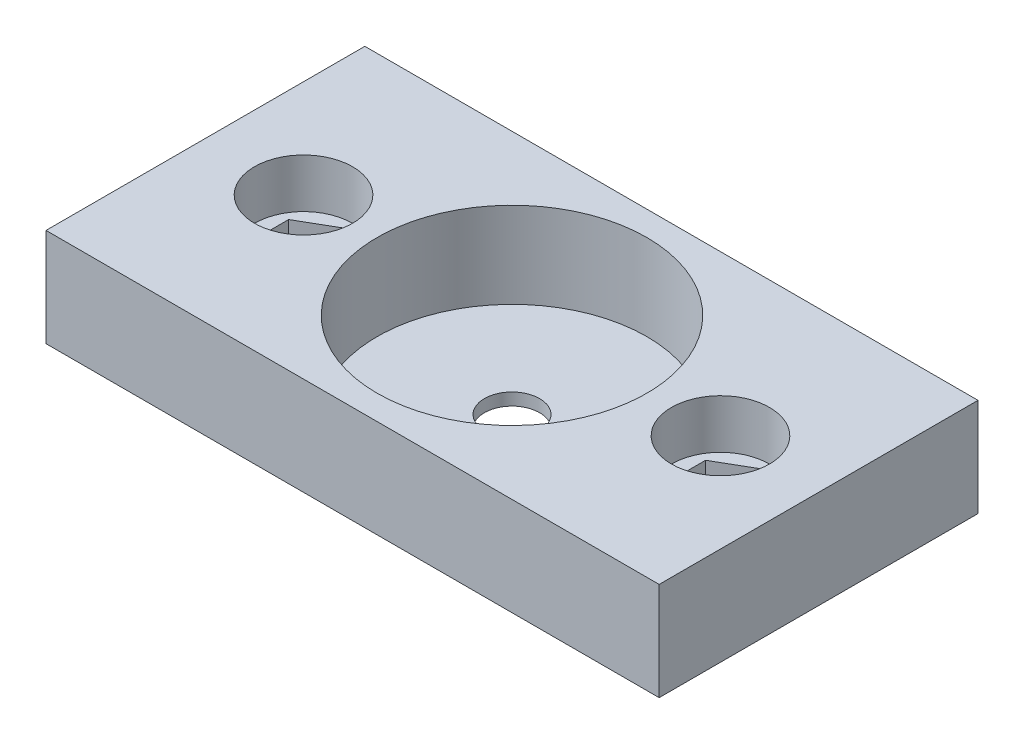
ISO-10303-21;
HEADER;
FILE_DESCRIPTION(('STEP AP214'),'2;1');
FILE_NAME('part.step','',(''),(''),'','','');
FILE_SCHEMA(('AUTOMOTIVE_DESIGN { 1 0 10303 214 1 1 1 1 }'));
ENDSEC;
DATA;
#1=APPLICATION_CONTEXT('core data for automotive mechanical design processes');
#2=APPLICATION_PROTOCOL_DEFINITION('international standard','automotive_design',2000,#1);
#3=PRODUCT_CONTEXT('',#1,'mechanical');
#4=PRODUCT('Part','Part','',(#3));
#5=PRODUCT_RELATED_PRODUCT_CATEGORY('part','',(#4));
#6=PRODUCT_DEFINITION_FORMATION('','',#4);
#7=PRODUCT_DEFINITION_CONTEXT('part definition',#1,'design');
#8=PRODUCT_DEFINITION('design','',#6,#7);
#9=PRODUCT_DEFINITION_SHAPE('','',#8);
#10=(LENGTH_UNIT() NAMED_UNIT(*) SI_UNIT(.MILLI.,.METRE.));
#11=(NAMED_UNIT(*) PLANE_ANGLE_UNIT() SI_UNIT($,.RADIAN.));
#12=(NAMED_UNIT(*) SI_UNIT($,.STERADIAN.) SOLID_ANGLE_UNIT());
#13=UNCERTAINTY_MEASURE_WITH_UNIT(LENGTH_MEASURE(1.E-05),#10,'distance_accuracy_value','');
#14=(GEOMETRIC_REPRESENTATION_CONTEXT(3) GLOBAL_UNCERTAINTY_ASSIGNED_CONTEXT((#13)) GLOBAL_UNIT_ASSIGNED_CONTEXT((#10,
#11,#12)) REPRESENTATION_CONTEXT('',''));
#15=CARTESIAN_POINT('',(0.,0.,0.));
#16=DIRECTION('',(0.,0.,1.));
#17=DIRECTION('',(1.,0.,0.));
#18=AXIS2_PLACEMENT_3D('',#15,#16,#17);
#19=CARTESIAN_POINT('',(-17.,4.,0.));
#20=DIRECTION('',(0.,-1.,0.));
#21=DIRECTION('',(0.,0.,-1.));
#22=AXIS2_PLACEMENT_3D('',#19,#20,#21);
#23=PLANE('',#22);
#24=CARTESIAN_POINT('',(-17.,4.,0.));
#25=DIRECTION('',(0.,1.,0.));
#26=DIRECTION('',(0.,0.,-1.));
#27=AXIS2_PLACEMENT_3D('',#24,#25,#26);
#28=CIRCLE('',#27,4.00000000000001);
#29=CARTESIAN_POINT('',(-17.,4.,-4.00000000000001));
#30=VERTEX_POINT('',#29);
#31=EDGE_CURVE('E265',#30,#30,#28,.T.);
#32=ORIENTED_EDGE('',*,*,#31,.T.);
#33=EDGE_LOOP('',(#32));
#34=FACE_BOUND('',#33,.T.);
#35=DIRECTION('',(0.866025403784438,0.,-0.5));
#36=VECTOR('',#35,1.);
#37=CARTESIAN_POINT('',(-14.125,4.,1.65988202392018));
#38=LINE('',#37,#36);
#39=CARTESIAN_POINT('',(-17.,4.,3.31976404784035));
#40=VERTEX_POINT('',#39);
#41=CARTESIAN_POINT('',(-14.125,4.,1.65988202392018));
#42=VERTEX_POINT('',#41);
#43=EDGE_CURVE('E233',#40,#42,#38,.T.);
#44=ORIENTED_EDGE('',*,*,#43,.F.);
#45=DIRECTION('',(0.866025403784439,0.,0.5));
#46=VECTOR('',#45,1.);
#47=CARTESIAN_POINT('',(-17.,4.,3.31976404784035));
#48=LINE('',#47,#46);
#49=CARTESIAN_POINT('',(-19.875,4.,1.65988202392017));
#50=VERTEX_POINT('',#49);
#51=EDGE_CURVE('E217',#50,#40,#48,.T.);
#52=ORIENTED_EDGE('',*,*,#51,.F.);
#53=DIRECTION('',(0.,0.,1.));
#54=VECTOR('',#53,1.);
#55=CARTESIAN_POINT('',(-19.875,4.,1.65988202392017));
#56=LINE('',#55,#54);
#57=CARTESIAN_POINT('',(-19.875,4.,-1.65988202392018));
#58=VERTEX_POINT('',#57);
#59=EDGE_CURVE('E54',#58,#50,#56,.T.);
#60=ORIENTED_EDGE('',*,*,#59,.F.);
#61=DIRECTION('',(-0.866025403784439,0.,0.5));
#62=VECTOR('',#61,1.);
#63=CARTESIAN_POINT('',(-19.875,4.,-1.65988202392018));
#64=LINE('',#63,#62);
#65=CARTESIAN_POINT('',(-17.,4.,-3.31976404784035));
#66=VERTEX_POINT('',#65);
#67=EDGE_CURVE('E242',#66,#58,#64,.T.);
#68=ORIENTED_EDGE('',*,*,#67,.F.);
#69=DIRECTION('',(-0.866025403784439,0.,-0.5));
#70=VECTOR('',#69,1.);
#71=CARTESIAN_POINT('',(-17.,4.,-3.31976404784035));
#72=LINE('',#71,#70);
#73=CARTESIAN_POINT('',(-14.125,4.,-1.65988202392018));
#74=VERTEX_POINT('',#73);
#75=EDGE_CURVE('E239',#74,#66,#72,.T.);
#76=ORIENTED_EDGE('',*,*,#75,.F.);
#77=DIRECTION('',(0.,0.,-1.));
#78=VECTOR('',#77,1.);
#79=CARTESIAN_POINT('',(-14.125,4.,-1.65988202392018));
#80=LINE('',#79,#78);
#81=EDGE_CURVE('E236',#42,#74,#80,.T.);
#82=ORIENTED_EDGE('',*,*,#81,.F.);
#83=EDGE_LOOP('',(#44,#52,#60,#68,#76,#82));
#84=FACE_BOUND('',#83,.T.);
#85=ADVANCED_FACE('F39',(#34,#84),#23,.F.);
#86=CARTESIAN_POINT('',(-25.,8.,-13.));
#87=DIRECTION('',(1.,0.,0.));
#88=DIRECTION('',(0.,0.,-1.));
#89=AXIS2_PLACEMENT_3D('',#86,#87,#88);
#90=PLANE('',#89);
#91=DIRECTION('',(0.,0.,1.));
#92=VECTOR('',#91,1.);
#93=CARTESIAN_POINT('',(-25.,0.,-13.));
#94=LINE('',#93,#92);
#95=CARTESIAN_POINT('',(-25.,0.,-13.));
#96=VERTEX_POINT('',#95);
#97=CARTESIAN_POINT('',(-25.,0.,13.));
#98=VERTEX_POINT('',#97);
#99=EDGE_CURVE('E281',#96,#98,#94,.T.);
#100=ORIENTED_EDGE('',*,*,#99,.T.);
#101=DIRECTION('',(0.,-1.,0.));
#102=VECTOR('',#101,1.);
#103=CARTESIAN_POINT('',(-25.,8.,13.));
#104=LINE('',#103,#102);
#105=CARTESIAN_POINT('',(-25.,8.,13.));
#106=VERTEX_POINT('',#105);
#107=EDGE_CURVE('E12',#106,#98,#104,.T.);
#108=ORIENTED_EDGE('',*,*,#107,.F.);
#109=DIRECTION('',(0.,0.,1.));
#110=VECTOR('',#109,1.);
#111=CARTESIAN_POINT('',(-25.,8.,-13.));
#112=LINE('',#111,#110);
#113=CARTESIAN_POINT('',(-25.,8.,-13.));
#114=VERTEX_POINT('',#113);
#115=EDGE_CURVE('E282',#114,#106,#112,.T.);
#116=ORIENTED_EDGE('',*,*,#115,.F.);
#117=DIRECTION('',(0.,-1.,0.));
#118=VECTOR('',#117,1.);
#119=CARTESIAN_POINT('',(-25.,8.,-13.));
#120=LINE('',#119,#118);
#121=EDGE_CURVE('E292',#114,#96,#120,.T.);
#122=ORIENTED_EDGE('',*,*,#121,.T.);
#123=EDGE_LOOP('',(#100,#108,#116,#122));
#124=FACE_BOUND('',#123,.T.);
#125=ADVANCED_FACE('F41',(#124),#90,.F.);
#126=CARTESIAN_POINT('',(-25.,8.,13.));
#127=DIRECTION('',(0.,0.,-1.));
#128=DIRECTION('',(-1.,0.,0.));
#129=AXIS2_PLACEMENT_3D('',#126,#127,#128);
#130=PLANE('',#129);
#131=DIRECTION('',(1.,0.,0.));
#132=VECTOR('',#131,1.);
#133=CARTESIAN_POINT('',(-25.,0.,13.));
#134=LINE('',#133,#132);
#135=CARTESIAN_POINT('',(25.,0.,13.));
#136=VERTEX_POINT('',#135);
#137=EDGE_CURVE('E295',#98,#136,#134,.T.);
#138=ORIENTED_EDGE('',*,*,#137,.T.);
#139=DIRECTION('',(0.,-1.,0.));
#140=VECTOR('',#139,1.);
#141=CARTESIAN_POINT('',(25.,8.,13.));
#142=LINE('',#141,#140);
#143=CARTESIAN_POINT('',(25.,8.,13.));
#144=VERTEX_POINT('',#143);
#145=EDGE_CURVE('E47',#144,#136,#142,.T.);
#146=ORIENTED_EDGE('',*,*,#145,.F.);
#147=DIRECTION('',(1.,0.,0.));
#148=VECTOR('',#147,1.);
#149=CARTESIAN_POINT('',(-25.,8.,13.));
#150=LINE('',#149,#148);
#151=EDGE_CURVE('E285',#106,#144,#150,.T.);
#152=ORIENTED_EDGE('',*,*,#151,.F.);
#153=ORIENTED_EDGE('',*,*,#107,.T.);
#154=EDGE_LOOP('',(#138,#146,#152,#153));
#155=FACE_BOUND('',#154,.T.);
#156=ADVANCED_FACE('F325',(#155),#130,.F.);
#157=CARTESIAN_POINT('',(25.,8.,-13.));
#158=DIRECTION('',(-1.,0.,0.));
#159=DIRECTION('',(0.,0.,1.));
#160=AXIS2_PLACEMENT_3D('',#157,#158,#159);
#161=PLANE('',#160);
#162=DIRECTION('',(0.,0.,-1.));
#163=VECTOR('',#162,1.);
#164=CARTESIAN_POINT('',(25.,0.,-13.));
#165=LINE('',#164,#163);
#166=CARTESIAN_POINT('',(25.,0.,-13.));
#167=VERTEX_POINT('',#166);
#168=EDGE_CURVE('E297',#136,#167,#165,.T.);
#169=ORIENTED_EDGE('',*,*,#168,.T.);
#170=DIRECTION('',(0.,-1.,0.));
#171=VECTOR('',#170,1.);
#172=CARTESIAN_POINT('',(25.,8.,-13.));
#173=LINE('',#172,#171);
#174=CARTESIAN_POINT('',(25.,8.,-13.));
#175=VERTEX_POINT('',#174);
#176=EDGE_CURVE('E302',#175,#167,#173,.T.);
#177=ORIENTED_EDGE('',*,*,#176,.F.);
#178=DIRECTION('',(0.,0.,-1.));
#179=VECTOR('',#178,1.);
#180=CARTESIAN_POINT('',(25.,8.,-13.));
#181=LINE('',#180,#179);
#182=EDGE_CURVE('E288',#144,#175,#181,.T.);
#183=ORIENTED_EDGE('',*,*,#182,.F.);
#184=ORIENTED_EDGE('',*,*,#145,.T.);
#185=EDGE_LOOP('',(#169,#177,#183,#184));
#186=FACE_BOUND('',#185,.T.);
#187=ADVANCED_FACE('F309',(#186),#161,.F.);
#188=CARTESIAN_POINT('',(-25.,8.,-13.));
#189=DIRECTION('',(0.,0.,1.));
#190=DIRECTION('',(1.,0.,0.));
#191=AXIS2_PLACEMENT_3D('',#188,#189,#190);
#192=PLANE('',#191);
#193=DIRECTION('',(-1.,0.,0.));
#194=VECTOR('',#193,1.);
#195=CARTESIAN_POINT('',(-25.,0.,-13.));
#196=LINE('',#195,#194);
#197=EDGE_CURVE('E286',#167,#96,#196,.T.);
#198=ORIENTED_EDGE('',*,*,#197,.T.);
#199=ORIENTED_EDGE('',*,*,#121,.F.);
#200=DIRECTION('',(-1.,0.,0.));
#201=VECTOR('',#200,1.);
#202=CARTESIAN_POINT('',(-25.,8.,-13.));
#203=LINE('',#202,#201);
#204=EDGE_CURVE('E290',#175,#114,#203,.T.);
#205=ORIENTED_EDGE('',*,*,#204,.F.);
#206=ORIENTED_EDGE('',*,*,#176,.T.);
#207=EDGE_LOOP('',(#198,#199,#205,#206));
#208=FACE_BOUND('',#207,.T.);
#209=ADVANCED_FACE('F318',(#208),#192,.F.);
#210=CARTESIAN_POINT('',(0.,8.,0.));
#211=DIRECTION('',(0.,1.,0.));
#212=DIRECTION('',(0.,0.,1.));
#213=AXIS2_PLACEMENT_3D('',#210,#211,#212);
#214=PLANE('',#213);
#215=CARTESIAN_POINT('',(17.,8.,0.));
#216=DIRECTION('',(0.,1.,0.));
#217=DIRECTION('',(0.,0.,1.));
#218=AXIS2_PLACEMENT_3D('',#215,#216,#217);
#219=CIRCLE('',#218,4.00000000000001);
#220=CARTESIAN_POINT('',(17.,8.,4.00000000000001));
#221=VERTEX_POINT('',#220);
#222=EDGE_CURVE('E262',#221,#221,#219,.T.);
#223=ORIENTED_EDGE('',*,*,#222,.F.);
#224=EDGE_LOOP('',(#223));
#225=FACE_BOUND('',#224,.T.);
#226=CARTESIAN_POINT('',(-17.,8.,0.));
#227=DIRECTION('',(0.,1.,0.));
#228=DIRECTION('',(0.,0.,-1.));
#229=AXIS2_PLACEMENT_3D('',#226,#227,#228);
#230=CIRCLE('',#229,4.00000000000001);
#231=CARTESIAN_POINT('',(-17.,8.,-4.00000000000001));
#232=VERTEX_POINT('',#231);
#233=EDGE_CURVE('E205',#232,#232,#230,.T.);
#234=ORIENTED_EDGE('',*,*,#233,.F.);
#235=EDGE_LOOP('',(#234));
#236=FACE_BOUND('',#235,.T.);
#237=CARTESIAN_POINT('',(0.,8.,0.));
#238=DIRECTION('',(0.,1.,0.));
#239=DIRECTION('',(0.,0.,1.));
#240=AXIS2_PLACEMENT_3D('',#237,#238,#239);
#241=CIRCLE('',#240,11.);
#242=CARTESIAN_POINT('',(0.,8.,11.));
#243=VERTEX_POINT('',#242);
#244=EDGE_CURVE('E273',#243,#243,#241,.T.);
#245=ORIENTED_EDGE('',*,*,#244,.F.);
#246=EDGE_LOOP('',(#245));
#247=FACE_BOUND('',#246,.T.);
#248=ORIENTED_EDGE('',*,*,#115,.T.);
#249=ORIENTED_EDGE('',*,*,#151,.T.);
#250=ORIENTED_EDGE('',*,*,#182,.T.);
#251=ORIENTED_EDGE('',*,*,#204,.T.);
#252=EDGE_LOOP('',(#248,#249,#250,#251));
#253=FACE_BOUND('',#252,.T.);
#254=ADVANCED_FACE('F324',(#225,#236,#247,#253),#214,.T.);
#255=CARTESIAN_POINT('',(0.,0.,0.));
#256=DIRECTION('',(0.,1.,0.));
#257=DIRECTION('',(0.,0.,1.));
#258=AXIS2_PLACEMENT_3D('',#255,#256,#257);
#259=PLANE('',#258);
#260=CARTESIAN_POINT('',(17.,0.,0.));
#261=DIRECTION('',(0.,1.,0.));
#262=DIRECTION('',(0.,0.,1.));
#263=AXIS2_PLACEMENT_3D('',#260,#261,#262);
#264=CIRCLE('',#263,1.7);
#265=CARTESIAN_POINT('',(17.,0.,1.7));
#266=VERTEX_POINT('',#265);
#267=EDGE_CURVE('E600',#266,#266,#264,.T.);
#268=ORIENTED_EDGE('',*,*,#267,.T.);
#269=EDGE_LOOP('',(#268));
#270=FACE_BOUND('',#269,.T.);
#271=CARTESIAN_POINT('',(-17.,0.,0.));
#272=DIRECTION('',(0.,1.,0.));
#273=DIRECTION('',(0.,0.,1.));
#274=AXIS2_PLACEMENT_3D('',#271,#272,#273);
#275=CIRCLE('',#274,1.7);
#276=CARTESIAN_POINT('',(-17.,0.,1.7));
#277=VERTEX_POINT('',#276);
#278=EDGE_CURVE('E182',#277,#277,#275,.T.);
#279=ORIENTED_EDGE('',*,*,#278,.T.);
#280=EDGE_LOOP('',(#279));
#281=FACE_BOUND('',#280,.T.);
#282=CARTESIAN_POINT('',(0.,0.,0.));
#283=DIRECTION('',(0.,1.,0.));
#284=DIRECTION('',(0.,0.,1.));
#285=AXIS2_PLACEMENT_3D('',#282,#283,#284);
#286=CIRCLE('',#285,2.25);
#287=CARTESIAN_POINT('',(0.,0.,2.25));
#288=VERTEX_POINT('',#287);
#289=EDGE_CURVE('E270',#288,#288,#286,.T.);
#290=ORIENTED_EDGE('',*,*,#289,.T.);
#291=EDGE_LOOP('',(#290));
#292=FACE_BOUND('',#291,.T.);
#293=ORIENTED_EDGE('',*,*,#99,.F.);
#294=ORIENTED_EDGE('',*,*,#197,.F.);
#295=ORIENTED_EDGE('',*,*,#168,.F.);
#296=ORIENTED_EDGE('',*,*,#137,.F.);
#297=EDGE_LOOP('',(#293,#294,#295,#296));
#298=FACE_BOUND('',#297,.T.);
#299=ADVANCED_FACE('F315',(#270,#281,#292,#298),#259,.F.);
#300=CARTESIAN_POINT('',(0.,-31.1126983722081,0.));
#301=DIRECTION('',(0.,1.,0.));
#302=DIRECTION('',(0.,0.,1.));
#303=AXIS2_PLACEMENT_3D('',#300,#301,#302);
#304=CYLINDRICAL_SURFACE('',#303,11.);
#305=CARTESIAN_POINT('',(0.,1.,0.));
#306=DIRECTION('',(0.,1.,0.));
#307=DIRECTION('',(0.,0.,1.));
#308=AXIS2_PLACEMENT_3D('',#305,#306,#307);
#309=CIRCLE('',#308,11.);
#310=CARTESIAN_POINT('',(0.,1.,11.));
#311=VERTEX_POINT('',#310);
#312=EDGE_CURVE('E278',#311,#311,#309,.F.);
#313=ORIENTED_EDGE('',*,*,#312,.T.);
#314=EDGE_LOOP('',(#313));
#315=FACE_BOUND('',#314,.T.);
#316=ORIENTED_EDGE('',*,*,#244,.T.);
#317=EDGE_LOOP('',(#316));
#318=FACE_BOUND('',#317,.T.);
#319=ADVANCED_FACE('F353',(#315,#318),#304,.F.);
#320=CARTESIAN_POINT('',(0.,1.,0.));
#321=DIRECTION('',(0.,1.,0.));
#322=DIRECTION('',(0.,0.,1.));
#323=AXIS2_PLACEMENT_3D('',#320,#321,#322);
#324=PLANE('',#323);
#325=CARTESIAN_POINT('',(0.,1.,0.));
#326=DIRECTION('',(0.,1.,0.));
#327=DIRECTION('',(0.,0.,1.));
#328=AXIS2_PLACEMENT_3D('',#325,#326,#327);
#329=CIRCLE('',#328,2.25);
#330=CARTESIAN_POINT('',(0.,1.,2.25));
#331=VERTEX_POINT('',#330);
#332=EDGE_CURVE('E261',#331,#331,#329,.T.);
#333=ORIENTED_EDGE('',*,*,#332,.F.);
#334=EDGE_LOOP('',(#333));
#335=FACE_BOUND('',#334,.T.);
#336=ORIENTED_EDGE('',*,*,#312,.F.);
#337=EDGE_LOOP('',(#336));
#338=FACE_BOUND('',#337,.T.);
#339=ADVANCED_FACE('F349',(#335,#338),#324,.T.);
#340=CARTESIAN_POINT('',(0.,0.,0.));
#341=DIRECTION('',(0.,1.,0.));
#342=DIRECTION('',(0.,0.,1.));
#343=AXIS2_PLACEMENT_3D('',#340,#341,#342);
#344=CYLINDRICAL_SURFACE('',#343,2.25);
#345=ORIENTED_EDGE('',*,*,#289,.F.);
#346=EDGE_LOOP('',(#345));
#347=FACE_BOUND('',#346,.T.);
#348=ORIENTED_EDGE('',*,*,#332,.T.);
#349=EDGE_LOOP('',(#348));
#350=FACE_BOUND('',#349,.T.);
#351=ADVANCED_FACE('F345',(#347,#350),#344,.F.);
#352=CARTESIAN_POINT('',(-17.,4.,0.));
#353=DIRECTION('',(0.,1.,0.));
#354=DIRECTION('',(0.,0.,1.));
#355=AXIS2_PLACEMENT_3D('',#352,#353,#354);
#356=CYLINDRICAL_SURFACE('',#355,4.00000000000001);
#357=ORIENTED_EDGE('',*,*,#31,.F.);
#358=EDGE_LOOP('',(#357));
#359=FACE_BOUND('',#358,.T.);
#360=ORIENTED_EDGE('',*,*,#233,.T.);
#361=EDGE_LOOP('',(#360));
#362=FACE_BOUND('',#361,.T.);
#363=ADVANCED_FACE('F342',(#359,#362),#356,.F.);
#364=CARTESIAN_POINT('',(17.,4.,0.));
#365=DIRECTION('',(0.,1.,0.));
#366=DIRECTION('',(0.,0.,1.));
#367=AXIS2_PLACEMENT_3D('',#364,#365,#366);
#368=CYLINDRICAL_SURFACE('',#367,4.00000000000001);
#369=CARTESIAN_POINT('',(17.,4.,0.));
#370=DIRECTION('',(0.,1.,0.));
#371=DIRECTION('',(0.,0.,1.));
#372=AXIS2_PLACEMENT_3D('',#369,#370,#371);
#373=CIRCLE('',#372,4.00000000000001);
#374=CARTESIAN_POINT('',(17.,4.,4.00000000000001));
#375=VERTEX_POINT('',#374);
#376=EDGE_CURVE('E258',#375,#375,#373,.T.);
#377=ORIENTED_EDGE('',*,*,#376,.F.);
#378=EDGE_LOOP('',(#377));
#379=FACE_BOUND('',#378,.T.);
#380=ORIENTED_EDGE('',*,*,#222,.T.);
#381=EDGE_LOOP('',(#380));
#382=FACE_BOUND('',#381,.T.);
#383=ADVANCED_FACE('F340',(#379,#382),#368,.F.);
#384=CARTESIAN_POINT('',(17.,4.,0.));
#385=DIRECTION('',(0.,1.,0.));
#386=DIRECTION('',(0.,0.,1.));
#387=AXIS2_PLACEMENT_3D('',#384,#385,#386);
#388=PLANE('',#387);
#389=DIRECTION('',(0.866025403784439,0.,-0.5));
#390=VECTOR('',#389,1.);
#391=CARTESIAN_POINT('',(17.,4.,3.31976404784035));
#392=LINE('',#391,#390);
#393=CARTESIAN_POINT('',(17.,4.,3.31976404784035));
#394=VERTEX_POINT('',#393);
#395=CARTESIAN_POINT('',(19.875,4.,1.65988202392017));
#396=VERTEX_POINT('',#395);
#397=EDGE_CURVE('E159',#394,#396,#392,.T.);
#398=ORIENTED_EDGE('',*,*,#397,.F.);
#399=DIRECTION('',(0.866025403784438,0.,0.5));
#400=VECTOR('',#399,1.);
#401=CARTESIAN_POINT('',(14.125,4.,1.65988202392018));
#402=LINE('',#401,#400);
#403=CARTESIAN_POINT('',(14.125,4.,1.65988202392018));
#404=VERTEX_POINT('',#403);
#405=EDGE_CURVE('E177',#404,#394,#402,.T.);
#406=ORIENTED_EDGE('',*,*,#405,.F.);
#407=DIRECTION('',(0.,0.,1.));
#408=VECTOR('',#407,1.);
#409=CARTESIAN_POINT('',(14.125,4.,-1.65988202392018));
#410=LINE('',#409,#408);
#411=CARTESIAN_POINT('',(14.125,4.,-1.65988202392018));
#412=VERTEX_POINT('',#411);
#413=EDGE_CURVE('E62',#412,#404,#410,.T.);
#414=ORIENTED_EDGE('',*,*,#413,.F.);
#415=DIRECTION('',(-0.866025403784439,0.,0.5));
#416=VECTOR('',#415,1.);
#417=CARTESIAN_POINT('',(17.,4.,-3.31976404784035));
#418=LINE('',#417,#416);
#419=CARTESIAN_POINT('',(17.,4.,-3.31976404784035));
#420=VERTEX_POINT('',#419);
#421=EDGE_CURVE('E199',#420,#412,#418,.T.);
#422=ORIENTED_EDGE('',*,*,#421,.F.);
#423=DIRECTION('',(-0.866025403784439,0.,-0.5));
#424=VECTOR('',#423,1.);
#425=CARTESIAN_POINT('',(19.875,4.,-1.65988202392018));
#426=LINE('',#425,#424);
#427=CARTESIAN_POINT('',(19.875,4.,-1.65988202392018));
#428=VERTEX_POINT('',#427);
#429=EDGE_CURVE('E196',#428,#420,#426,.T.);
#430=ORIENTED_EDGE('',*,*,#429,.F.);
#431=DIRECTION('',(0.,0.,-1.));
#432=VECTOR('',#431,1.);
#433=CARTESIAN_POINT('',(19.875,4.,1.65988202392017));
#434=LINE('',#433,#432);
#435=EDGE_CURVE('E193',#396,#428,#434,.T.);
#436=ORIENTED_EDGE('',*,*,#435,.F.);
#437=EDGE_LOOP('',(#398,#406,#414,#422,#430,#436));
#438=FACE_BOUND('',#437,.T.);
#439=ORIENTED_EDGE('',*,*,#376,.T.);
#440=EDGE_LOOP('',(#439));
#441=FACE_BOUND('',#440,.T.);
#442=ADVANCED_FACE('F401',(#438,#441),#388,.T.);
#443=CARTESIAN_POINT('',(17.,1.8,3.31976404784035));
#444=DIRECTION('',(0.5,0.,0.866025403784438));
#445=DIRECTION('',(0.866025403784439,0.,-0.5));
#446=AXIS2_PLACEMENT_3D('',#443,#444,#445);
#447=PLANE('',#446);
#448=ORIENTED_EDGE('',*,*,#397,.T.);
#449=DIRECTION('',(0.,1.,0.));
#450=VECTOR('',#449,1.);
#451=CARTESIAN_POINT('',(19.875,1.8,1.65988202392017));
#452=LINE('',#451,#450);
#453=CARTESIAN_POINT('',(19.875,1.8,1.65988202392017));
#454=VERTEX_POINT('',#453);
#455=EDGE_CURVE('E152',#454,#396,#452,.T.);
#456=ORIENTED_EDGE('',*,*,#455,.F.);
#457=DIRECTION('',(0.866025403784439,0.,-0.5));
#458=VECTOR('',#457,1.);
#459=CARTESIAN_POINT('',(17.,1.8,3.31976404784035));
#460=LINE('',#459,#458);
#461=CARTESIAN_POINT('',(17.,1.8,3.31976404784035));
#462=VERTEX_POINT('',#461);
#463=EDGE_CURVE('E156',#462,#454,#460,.T.);
#464=ORIENTED_EDGE('',*,*,#463,.F.);
#465=DIRECTION('',(0.,1.,0.));
#466=VECTOR('',#465,1.);
#467=CARTESIAN_POINT('',(17.,1.8,3.31976404784035));
#468=LINE('',#467,#466);
#469=EDGE_CURVE('E203',#462,#394,#468,.T.);
#470=ORIENTED_EDGE('',*,*,#469,.T.);
#471=EDGE_LOOP('',(#448,#456,#464,#470));
#472=FACE_BOUND('',#471,.T.);
#473=ADVANCED_FACE('F154',(#472),#447,.F.);
#474=CARTESIAN_POINT('',(14.125,1.8,1.65988202392018));
#475=DIRECTION('',(-0.5,0.,0.866025403784438));
#476=DIRECTION('',(0.866025403784438,0.,0.5));
#477=AXIS2_PLACEMENT_3D('',#474,#475,#476);
#478=PLANE('',#477);
#479=ORIENTED_EDGE('',*,*,#405,.T.);
#480=ORIENTED_EDGE('',*,*,#469,.F.);
#481=DIRECTION('',(0.866025403784438,0.,0.5));
#482=VECTOR('',#481,1.);
#483=CARTESIAN_POINT('',(14.125,1.8,1.65988202392018));
#484=LINE('',#483,#482);
#485=CARTESIAN_POINT('',(14.125,1.8,1.65988202392018));
#486=VERTEX_POINT('',#485);
#487=EDGE_CURVE('E164',#486,#462,#484,.T.);
#488=ORIENTED_EDGE('',*,*,#487,.F.);
#489=DIRECTION('',(0.,1.,0.));
#490=VECTOR('',#489,1.);
#491=CARTESIAN_POINT('',(14.125,1.8,1.65988202392018));
#492=LINE('',#491,#490);
#493=EDGE_CURVE('E206',#486,#404,#492,.T.);
#494=ORIENTED_EDGE('',*,*,#493,.T.);
#495=EDGE_LOOP('',(#479,#480,#488,#494));
#496=FACE_BOUND('',#495,.T.);
#497=ADVANCED_FACE('F414',(#496),#478,.F.);
#498=CARTESIAN_POINT('',(14.125,1.8,-1.65988202392018));
#499=DIRECTION('',(-1.,0.,0.));
#500=DIRECTION('',(0.,0.,1.));
#501=AXIS2_PLACEMENT_3D('',#498,#499,#500);
#502=PLANE('',#501);
#503=ORIENTED_EDGE('',*,*,#413,.T.);
#504=ORIENTED_EDGE('',*,*,#493,.F.);
#505=DIRECTION('',(0.,0.,1.));
#506=VECTOR('',#505,1.);
#507=CARTESIAN_POINT('',(14.125,1.8,-1.65988202392018));
#508=LINE('',#507,#506);
#509=CARTESIAN_POINT('',(14.125,1.8,-1.65988202392018));
#510=VERTEX_POINT('',#509);
#511=EDGE_CURVE('E189',#510,#486,#508,.T.);
#512=ORIENTED_EDGE('',*,*,#511,.F.);
#513=DIRECTION('',(0.,1.,0.));
#514=VECTOR('',#513,1.);
#515=CARTESIAN_POINT('',(14.125,1.8,-1.65988202392018));
#516=LINE('',#515,#514);
#517=EDGE_CURVE('E208',#510,#412,#516,.T.);
#518=ORIENTED_EDGE('',*,*,#517,.T.);
#519=EDGE_LOOP('',(#503,#504,#512,#518));
#520=FACE_BOUND('',#519,.T.);
#521=ADVANCED_FACE('F421',(#520),#502,.F.);
#522=CARTESIAN_POINT('',(17.,1.8,-3.31976404784035));
#523=DIRECTION('',(-0.5,0.,-0.866025403784438));
#524=DIRECTION('',(-0.866025403784439,0.,0.5));
#525=AXIS2_PLACEMENT_3D('',#522,#523,#524);
#526=PLANE('',#525);
#527=ORIENTED_EDGE('',*,*,#421,.T.);
#528=ORIENTED_EDGE('',*,*,#517,.F.);
#529=DIRECTION('',(-0.866025403784439,0.,0.5));
#530=VECTOR('',#529,1.);
#531=CARTESIAN_POINT('',(17.,1.8,-3.31976404784035));
#532=LINE('',#531,#530);
#533=CARTESIAN_POINT('',(17.,1.8,-3.31976404784035));
#534=VERTEX_POINT('',#533);
#535=EDGE_CURVE('E186',#534,#510,#532,.T.);
#536=ORIENTED_EDGE('',*,*,#535,.F.);
#537=DIRECTION('',(0.,1.,0.));
#538=VECTOR('',#537,1.);
#539=CARTESIAN_POINT('',(17.,1.8,-3.31976404784035));
#540=LINE('',#539,#538);
#541=EDGE_CURVE('E210',#534,#420,#540,.T.);
#542=ORIENTED_EDGE('',*,*,#541,.T.);
#543=EDGE_LOOP('',(#527,#528,#536,#542));
#544=FACE_BOUND('',#543,.T.);
#545=ADVANCED_FACE('F429',(#544),#526,.F.);
#546=CARTESIAN_POINT('',(19.875,1.8,-1.65988202392018));
#547=DIRECTION('',(0.5,0.,-0.866025403784438));
#548=DIRECTION('',(-0.866025403784439,0.,-0.5));
#549=AXIS2_PLACEMENT_3D('',#546,#547,#548);
#550=PLANE('',#549);
#551=ORIENTED_EDGE('',*,*,#429,.T.);
#552=ORIENTED_EDGE('',*,*,#541,.F.);
#553=DIRECTION('',(-0.866025403784439,0.,-0.5));
#554=VECTOR('',#553,1.);
#555=CARTESIAN_POINT('',(19.875,1.8,-1.65988202392018));
#556=LINE('',#555,#554);
#557=CARTESIAN_POINT('',(19.875,1.8,-1.65988202392018));
#558=VERTEX_POINT('',#557);
#559=EDGE_CURVE('E172',#558,#534,#556,.T.);
#560=ORIENTED_EDGE('',*,*,#559,.F.);
#561=DIRECTION('',(0.,1.,0.));
#562=VECTOR('',#561,1.);
#563=CARTESIAN_POINT('',(19.875,1.8,-1.65988202392018));
#564=LINE('',#563,#562);
#565=EDGE_CURVE('E163',#558,#428,#564,.T.);
#566=ORIENTED_EDGE('',*,*,#565,.T.);
#567=EDGE_LOOP('',(#551,#552,#560,#566));
#568=FACE_BOUND('',#567,.T.);
#569=ADVANCED_FACE('F436',(#568),#550,.F.);
#570=CARTESIAN_POINT('',(19.875,1.8,1.65988202392017));
#571=DIRECTION('',(1.,0.,0.));
#572=DIRECTION('',(0.,0.,-1.));
#573=AXIS2_PLACEMENT_3D('',#570,#571,#572);
#574=PLANE('',#573);
#575=ORIENTED_EDGE('',*,*,#435,.T.);
#576=ORIENTED_EDGE('',*,*,#565,.F.);
#577=DIRECTION('',(0.,0.,-1.));
#578=VECTOR('',#577,1.);
#579=CARTESIAN_POINT('',(19.875,1.8,1.65988202392017));
#580=LINE('',#579,#578);
#581=EDGE_CURVE('E167',#454,#558,#580,.T.);
#582=ORIENTED_EDGE('',*,*,#581,.F.);
#583=ORIENTED_EDGE('',*,*,#455,.T.);
#584=EDGE_LOOP('',(#575,#576,#582,#583));
#585=FACE_BOUND('',#584,.T.);
#586=ADVANCED_FACE('F168',(#585),#574,.F.);
#587=CARTESIAN_POINT('',(0.,1.8,0.));
#588=DIRECTION('',(0.,1.,0.));
#589=DIRECTION('',(0.,0.,1.));
#590=AXIS2_PLACEMENT_3D('',#587,#588,#589);
#591=PLANE('',#590);
#592=CARTESIAN_POINT('',(17.,1.8,0.));
#593=DIRECTION('',(0.,1.,0.));
#594=DIRECTION('',(0.,0.,1.));
#595=AXIS2_PLACEMENT_3D('',#592,#593,#594);
#596=CIRCLE('',#595,1.7);
#597=CARTESIAN_POINT('',(17.,1.8,1.7));
#598=VERTEX_POINT('',#597);
#599=EDGE_CURVE('E603',#598,#598,#596,.T.);
#600=ORIENTED_EDGE('',*,*,#599,.F.);
#601=EDGE_LOOP('',(#600));
#602=FACE_BOUND('',#601,.T.);
#603=ORIENTED_EDGE('',*,*,#463,.T.);
#604=ORIENTED_EDGE('',*,*,#581,.T.);
#605=ORIENTED_EDGE('',*,*,#559,.T.);
#606=ORIENTED_EDGE('',*,*,#535,.T.);
#607=ORIENTED_EDGE('',*,*,#511,.T.);
#608=ORIENTED_EDGE('',*,*,#487,.T.);
#609=EDGE_LOOP('',(#603,#604,#605,#606,#607,#608));
#610=FACE_BOUND('',#609,.T.);
#611=ADVANCED_FACE('F174',(#602,#610),#591,.T.);
#612=CARTESIAN_POINT('',(-14.125,1.8,1.65988202392018));
#613=DIRECTION('',(0.5,0.,0.866025403784438));
#614=DIRECTION('',(0.866025403784438,0.,-0.5));
#615=AXIS2_PLACEMENT_3D('',#612,#613,#614);
#616=PLANE('',#615);
#617=ORIENTED_EDGE('',*,*,#43,.T.);
#618=DIRECTION('',(0.,1.,0.));
#619=VECTOR('',#618,1.);
#620=CARTESIAN_POINT('',(-14.125,1.8,1.65988202392018));
#621=LINE('',#620,#619);
#622=CARTESIAN_POINT('',(-14.125,1.8,1.65988202392018));
#623=VERTEX_POINT('',#622);
#624=EDGE_CURVE('E232',#623,#42,#621,.T.);
#625=ORIENTED_EDGE('',*,*,#624,.F.);
#626=DIRECTION('',(0.866025403784438,0.,-0.5));
#627=VECTOR('',#626,1.);
#628=CARTESIAN_POINT('',(-14.125,1.8,1.65988202392018));
#629=LINE('',#628,#627);
#630=CARTESIAN_POINT('',(-17.,1.8,3.31976404784035));
#631=VERTEX_POINT('',#630);
#632=EDGE_CURVE('E213',#631,#623,#629,.T.);
#633=ORIENTED_EDGE('',*,*,#632,.F.);
#634=DIRECTION('',(0.,1.,0.));
#635=VECTOR('',#634,1.);
#636=CARTESIAN_POINT('',(-17.,1.8,3.31976404784035));
#637=LINE('',#636,#635);
#638=EDGE_CURVE('E194',#631,#40,#637,.T.);
#639=ORIENTED_EDGE('',*,*,#638,.T.);
#640=EDGE_LOOP('',(#617,#625,#633,#639));
#641=FACE_BOUND('',#640,.T.);
#642=ADVANCED_FACE('F457',(#641),#616,.F.);
#643=CARTESIAN_POINT('',(-17.,1.8,3.31976404784035));
#644=DIRECTION('',(-0.5,0.,0.866025403784438));
#645=DIRECTION('',(0.866025403784439,0.,0.5));
#646=AXIS2_PLACEMENT_3D('',#643,#644,#645);
#647=PLANE('',#646);
#648=ORIENTED_EDGE('',*,*,#51,.T.);
#649=ORIENTED_EDGE('',*,*,#638,.F.);
#650=DIRECTION('',(0.866025403784439,0.,0.5));
#651=VECTOR('',#650,1.);
#652=CARTESIAN_POINT('',(-17.,1.8,3.31976404784035));
#653=LINE('',#652,#651);
#654=CARTESIAN_POINT('',(-19.875,1.8,1.65988202392017));
#655=VERTEX_POINT('',#654);
#656=EDGE_CURVE('E229',#655,#631,#653,.T.);
#657=ORIENTED_EDGE('',*,*,#656,.F.);
#658=DIRECTION('',(0.,1.,0.));
#659=VECTOR('',#658,1.);
#660=CARTESIAN_POINT('',(-19.875,1.8,1.65988202392017));
#661=LINE('',#660,#659);
#662=EDGE_CURVE('E249',#655,#50,#661,.T.);
#663=ORIENTED_EDGE('',*,*,#662,.T.);
#664=EDGE_LOOP('',(#648,#649,#657,#663));
#665=FACE_BOUND('',#664,.T.);
#666=ADVANCED_FACE('F465',(#665),#647,.F.);
#667=CARTESIAN_POINT('',(-19.875,1.8,1.65988202392017));
#668=DIRECTION('',(-1.,0.,0.));
#669=DIRECTION('',(0.,0.,1.));
#670=AXIS2_PLACEMENT_3D('',#667,#668,#669);
#671=PLANE('',#670);
#672=ORIENTED_EDGE('',*,*,#59,.T.);
#673=ORIENTED_EDGE('',*,*,#662,.F.);
#674=DIRECTION('',(0.,0.,1.));
#675=VECTOR('',#674,1.);
#676=CARTESIAN_POINT('',(-19.875,1.8,1.65988202392017));
#677=LINE('',#676,#675);
#678=CARTESIAN_POINT('',(-19.875,1.8,-1.65988202392018));
#679=VERTEX_POINT('',#678);
#680=EDGE_CURVE('E226',#679,#655,#677,.T.);
#681=ORIENTED_EDGE('',*,*,#680,.F.);
#682=DIRECTION('',(0.,1.,0.));
#683=VECTOR('',#682,1.);
#684=CARTESIAN_POINT('',(-19.875,1.8,-1.65988202392018));
#685=LINE('',#684,#683);
#686=EDGE_CURVE('E251',#679,#58,#685,.T.);
#687=ORIENTED_EDGE('',*,*,#686,.T.);
#688=EDGE_LOOP('',(#672,#673,#681,#687));
#689=FACE_BOUND('',#688,.T.);
#690=ADVANCED_FACE('F473',(#689),#671,.F.);
#691=CARTESIAN_POINT('',(-19.875,1.8,-1.65988202392018));
#692=DIRECTION('',(-0.5,0.,-0.866025403784438));
#693=DIRECTION('',(-0.866025403784439,0.,0.5));
#694=AXIS2_PLACEMENT_3D('',#691,#692,#693);
#695=PLANE('',#694);
#696=ORIENTED_EDGE('',*,*,#67,.T.);
#697=ORIENTED_EDGE('',*,*,#686,.F.);
#698=DIRECTION('',(-0.866025403784439,0.,0.5));
#699=VECTOR('',#698,1.);
#700=CARTESIAN_POINT('',(-19.875,1.8,-1.65988202392018));
#701=LINE('',#700,#699);
#702=CARTESIAN_POINT('',(-17.,1.8,-3.31976404784035));
#703=VERTEX_POINT('',#702);
#704=EDGE_CURVE('E223',#703,#679,#701,.T.);
#705=ORIENTED_EDGE('',*,*,#704,.F.);
#706=DIRECTION('',(0.,1.,0.));
#707=VECTOR('',#706,1.);
#708=CARTESIAN_POINT('',(-17.,1.8,-3.31976404784035));
#709=LINE('',#708,#707);
#710=EDGE_CURVE('E253',#703,#66,#709,.T.);
#711=ORIENTED_EDGE('',*,*,#710,.T.);
#712=EDGE_LOOP('',(#696,#697,#705,#711));
#713=FACE_BOUND('',#712,.T.);
#714=ADVANCED_FACE('F481',(#713),#695,.F.);
#715=CARTESIAN_POINT('',(-17.,1.8,-3.31976404784035));
#716=DIRECTION('',(0.5,0.,-0.866025403784438));
#717=DIRECTION('',(-0.866025403784439,0.,-0.5));
#718=AXIS2_PLACEMENT_3D('',#715,#716,#717);
#719=PLANE('',#718);
#720=ORIENTED_EDGE('',*,*,#75,.T.);
#721=ORIENTED_EDGE('',*,*,#710,.F.);
#722=DIRECTION('',(-0.866025403784439,0.,-0.5));
#723=VECTOR('',#722,1.);
#724=CARTESIAN_POINT('',(-17.,1.8,-3.31976404784035));
#725=LINE('',#724,#723);
#726=CARTESIAN_POINT('',(-14.125,1.8,-1.65988202392018));
#727=VERTEX_POINT('',#726);
#728=EDGE_CURVE('E220',#727,#703,#725,.T.);
#729=ORIENTED_EDGE('',*,*,#728,.F.);
#730=DIRECTION('',(0.,1.,0.));
#731=VECTOR('',#730,1.);
#732=CARTESIAN_POINT('',(-14.125,1.8,-1.65988202392018));
#733=LINE('',#732,#731);
#734=EDGE_CURVE('E255',#727,#74,#733,.T.);
#735=ORIENTED_EDGE('',*,*,#734,.T.);
#736=EDGE_LOOP('',(#720,#721,#729,#735));
#737=FACE_BOUND('',#736,.T.);
#738=ADVANCED_FACE('F488',(#737),#719,.F.);
#739=CARTESIAN_POINT('',(-14.125,1.8,-1.65988202392018));
#740=DIRECTION('',(1.,0.,0.));
#741=DIRECTION('',(0.,0.,-1.));
#742=AXIS2_PLACEMENT_3D('',#739,#740,#741);
#743=PLANE('',#742);
#744=ORIENTED_EDGE('',*,*,#81,.T.);
#745=ORIENTED_EDGE('',*,*,#734,.F.);
#746=DIRECTION('',(0.,0.,-1.));
#747=VECTOR('',#746,1.);
#748=CARTESIAN_POINT('',(-14.125,1.8,-1.65988202392018));
#749=LINE('',#748,#747);
#750=EDGE_CURVE('E216',#623,#727,#749,.T.);
#751=ORIENTED_EDGE('',*,*,#750,.F.);
#752=ORIENTED_EDGE('',*,*,#624,.T.);
#753=EDGE_LOOP('',(#744,#745,#751,#752));
#754=FACE_BOUND('',#753,.T.);
#755=ADVANCED_FACE('F496',(#754),#743,.F.);
#756=CARTESIAN_POINT('',(0.,1.8,0.));
#757=DIRECTION('',(0.,-1.,0.));
#758=DIRECTION('',(0.,0.,-1.));
#759=AXIS2_PLACEMENT_3D('',#756,#757,#758);
#760=PLANE('',#759);
#761=CARTESIAN_POINT('',(-17.,1.8,0.));
#762=DIRECTION('',(0.,1.,0.));
#763=DIRECTION('',(0.,0.,1.));
#764=AXIS2_PLACEMENT_3D('',#761,#762,#763);
#765=CIRCLE('',#764,1.7);
#766=CARTESIAN_POINT('',(-17.,1.8,1.7));
#767=VERTEX_POINT('',#766);
#768=EDGE_CURVE('E605',#767,#767,#765,.T.);
#769=ORIENTED_EDGE('',*,*,#768,.F.);
#770=EDGE_LOOP('',(#769));
#771=FACE_BOUND('',#770,.T.);
#772=ORIENTED_EDGE('',*,*,#632,.T.);
#773=ORIENTED_EDGE('',*,*,#750,.T.);
#774=ORIENTED_EDGE('',*,*,#728,.T.);
#775=ORIENTED_EDGE('',*,*,#704,.T.);
#776=ORIENTED_EDGE('',*,*,#680,.T.);
#777=ORIENTED_EDGE('',*,*,#656,.T.);
#778=EDGE_LOOP('',(#772,#773,#774,#775,#776,#777));
#779=FACE_BOUND('',#778,.T.);
#780=ADVANCED_FACE('F503',(#771,#779),#760,.F.);
#781=CARTESIAN_POINT('',(-17.,1.8,0.));
#782=DIRECTION('',(0.,1.,0.));
#783=DIRECTION('',(0.,0.,1.));
#784=AXIS2_PLACEMENT_3D('',#781,#782,#783);
#785=CYLINDRICAL_SURFACE('',#784,1.7);
#786=ORIENTED_EDGE('',*,*,#278,.F.);
#787=EDGE_LOOP('',(#786));
#788=FACE_BOUND('',#787,.T.);
#789=ORIENTED_EDGE('',*,*,#768,.T.);
#790=EDGE_LOOP('',(#789));
#791=FACE_BOUND('',#790,.T.);
#792=ADVANCED_FACE('F510',(#788,#791),#785,.F.);
#793=CARTESIAN_POINT('',(17.,1.8,0.));
#794=DIRECTION('',(0.,1.,0.));
#795=DIRECTION('',(0.,0.,1.));
#796=AXIS2_PLACEMENT_3D('',#793,#794,#795);
#797=CYLINDRICAL_SURFACE('',#796,1.7);
#798=ORIENTED_EDGE('',*,*,#267,.F.);
#799=EDGE_LOOP('',(#798));
#800=FACE_BOUND('',#799,.T.);
#801=ORIENTED_EDGE('',*,*,#599,.T.);
#802=EDGE_LOOP('',(#801));
#803=FACE_BOUND('',#802,.T.);
#804=ADVANCED_FACE('F518',(#800,#803),#797,.F.);
#805=CLOSED_SHELL('',(#85,#125,#156,#187,#209,#254,#299,#319,#339,#351,#363,#383,#442,#473,#497,
#521,#545,#569,#586,#611,#642,#666,#690,#714,#738,#755,#780,#792,#804));
#806=MANIFOLD_SOLID_BREP('B2',#805);
#807=ADVANCED_BREP_SHAPE_REPRESENTATION('',(#18,#806),#14);
#808=SHAPE_DEFINITION_REPRESENTATION(#9,#807);
ENDSEC;
END-ISO-10303-21;
